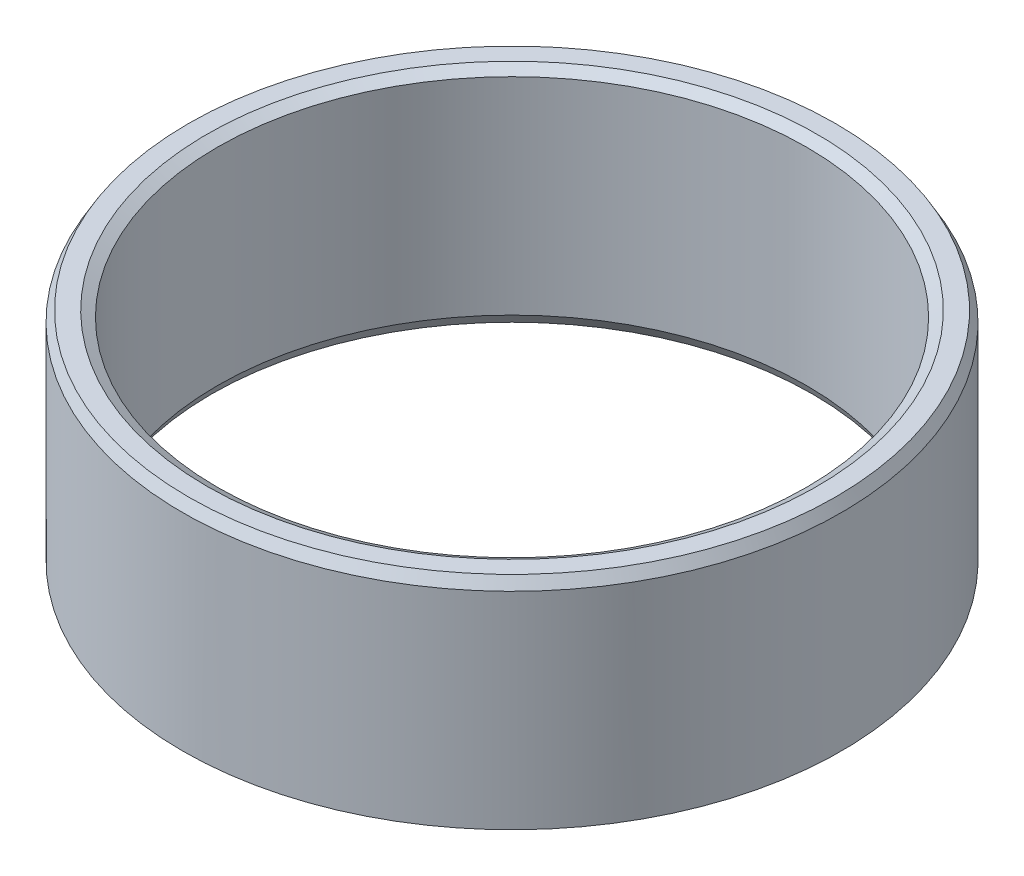
ISO-10303-21;
HEADER;
FILE_DESCRIPTION(('STEP AP214'),'2;1');
FILE_NAME('part.step','',(''),(''),'','','');
FILE_SCHEMA(('AUTOMOTIVE_DESIGN { 1 0 10303 214 1 1 1 1 }'));
ENDSEC;
DATA;
#1=APPLICATION_CONTEXT('core data for automotive mechanical design processes');
#2=APPLICATION_PROTOCOL_DEFINITION('international standard','automotive_design',2000,#1);
#3=PRODUCT_CONTEXT('',#1,'mechanical');
#4=PRODUCT('Part','Part','',(#3));
#5=PRODUCT_RELATED_PRODUCT_CATEGORY('part','',(#4));
#6=PRODUCT_DEFINITION_FORMATION('','',#4);
#7=PRODUCT_DEFINITION_CONTEXT('part definition',#1,'design');
#8=PRODUCT_DEFINITION('design','',#6,#7);
#9=PRODUCT_DEFINITION_SHAPE('','',#8);
#10=(LENGTH_UNIT() NAMED_UNIT(*) SI_UNIT(.MILLI.,.METRE.));
#11=(NAMED_UNIT(*) PLANE_ANGLE_UNIT() SI_UNIT($,.RADIAN.));
#12=(NAMED_UNIT(*) SI_UNIT($,.STERADIAN.) SOLID_ANGLE_UNIT());
#13=UNCERTAINTY_MEASURE_WITH_UNIT(LENGTH_MEASURE(1.E-05),#10,'distance_accuracy_value','');
#14=(GEOMETRIC_REPRESENTATION_CONTEXT(3) GLOBAL_UNCERTAINTY_ASSIGNED_CONTEXT((#13)) GLOBAL_UNIT_ASSIGNED_CONTEXT((#10,
#11,#12)) REPRESENTATION_CONTEXT('',''));
#15=CARTESIAN_POINT('',(0.,0.,0.));
#16=DIRECTION('',(0.,0.,1.));
#17=DIRECTION('',(1.,0.,0.));
#18=AXIS2_PLACEMENT_3D('',#15,#16,#17);
#19=CARTESIAN_POINT('',(0.,30.4410566035507,0.));
#20=DIRECTION('',(0.,-1.,0.));
#21=DIRECTION('',(0.,0.,-1.));
#22=AXIS2_PLACEMENT_3D('',#19,#20,#21);
#23=CYLINDRICAL_SURFACE('',#22,45.);
#24=CARTESIAN_POINT('',(0.,0.821626404880212,0.));
#25=DIRECTION('',(0.,1.,0.));
#26=DIRECTION('',(0.,0.,1.));
#27=AXIS2_PLACEMENT_3D('',#24,#25,#26);
#28=CIRCLE('',#27,45.);
#29=CARTESIAN_POINT('',(0.,0.821626404880212,45.));
#30=VERTEX_POINT('',#29);
#31=EDGE_CURVE('E10',#30,#30,#28,.T.);
#32=ORIENTED_EDGE('',*,*,#31,.T.);
#33=EDGE_LOOP('',(#32));
#34=FACE_BOUND('',#33,.T.);
#35=CARTESIAN_POINT('',(0.,29.0179579254579,0.));
#36=DIRECTION('',(0.,1.,0.));
#37=DIRECTION('',(0.,0.,1.));
#38=AXIS2_PLACEMENT_3D('',#35,#36,#37);
#39=CIRCLE('',#38,45.);
#40=CARTESIAN_POINT('',(0.,29.0179579254579,-45.));
#41=VERTEX_POINT('',#40);
#42=EDGE_CURVE('E50',#41,#41,#39,.F.);
#43=ORIENTED_EDGE('',*,*,#42,.T.);
#44=EDGE_LOOP('',(#43));
#45=FACE_BOUND('',#44,.T.);
#46=ADVANCED_FACE('F39',(#34,#45),#23,.T.);
#47=CARTESIAN_POINT('',(0.,30.4410566035507,0.));
#48=DIRECTION('',(0.,1.,0.));
#49=DIRECTION('',(0.,0.,1.));
#50=AXIS2_PLACEMENT_3D('',#47,#48,#49);
#51=PLANE('',#50);
#52=CARTESIAN_POINT('',(0.,30.4410566035507,0.));
#53=DIRECTION('',(0.,1.,0.));
#54=DIRECTION('',(0.,0.,1.));
#55=AXIS2_PLACEMENT_3D('',#52,#53,#54);
#56=CIRCLE('',#55,41.6506942153513);
#57=CARTESIAN_POINT('',(0.,30.4410566035507,41.6506942153513));
#58=VERTEX_POINT('',#57);
#59=EDGE_CURVE('E58',#58,#58,#56,.F.);
#60=ORIENTED_EDGE('',*,*,#59,.T.);
#61=EDGE_LOOP('',(#60));
#62=FACE_BOUND('',#61,.T.);
#63=CARTESIAN_POINT('',(0.,30.4410566035507,0.));
#64=DIRECTION('',(0.,1.,0.));
#65=DIRECTION('',(0.,0.,1.));
#66=AXIS2_PLACEMENT_3D('',#63,#64,#65);
#67=CIRCLE('',#66,44.1783735951198);
#68=CARTESIAN_POINT('',(0.,30.4410566035507,-44.1783735951198));
#69=VERTEX_POINT('',#68);
#70=EDGE_CURVE('E61',#69,#69,#67,.T.);
#71=ORIENTED_EDGE('',*,*,#70,.T.);
#72=EDGE_LOOP('',(#71));
#73=FACE_BOUND('',#72,.T.);
#74=ADVANCED_FACE('F88',(#62,#73),#51,.T.);
#75=CARTESIAN_POINT('',(0.,0.,0.));
#76=DIRECTION('',(0.,1.,0.));
#77=DIRECTION('',(0.,0.,1.));
#78=AXIS2_PLACEMENT_3D('',#75,#76,#77);
#79=PLANE('',#78);
#80=CARTESIAN_POINT('',(0.,0.,0.));
#81=DIRECTION('',(0.,1.,0.));
#82=DIRECTION('',(0.,0.,1.));
#83=AXIS2_PLACEMENT_3D('',#80,#81,#82);
#84=CIRCLE('',#83,41.0492219421388);
#85=CARTESIAN_POINT('',(0.,0.,41.0492219421388));
#86=VERTEX_POINT('',#85);
#87=EDGE_CURVE('E51',#86,#86,#84,.T.);
#88=ORIENTED_EDGE('',*,*,#87,.T.);
#89=EDGE_LOOP('',(#88));
#90=FACE_BOUND('',#89,.T.);
#91=CARTESIAN_POINT('',(0.,0.,0.));
#92=DIRECTION('',(0.,1.,0.));
#93=DIRECTION('',(0.,0.,1.));
#94=AXIS2_PLACEMENT_3D('',#91,#92,#93);
#95=CIRCLE('',#94,43.5769013219073);
#96=CARTESIAN_POINT('',(0.,0.,43.5769013219073));
#97=VERTEX_POINT('',#96);
#98=EDGE_CURVE('E54',#97,#97,#95,.F.);
#99=ORIENTED_EDGE('',*,*,#98,.T.);
#100=EDGE_LOOP('',(#99));
#101=FACE_BOUND('',#100,.T.);
#102=ADVANCED_FACE('F83',(#90,#101),#79,.F.);
#103=CARTESIAN_POINT('',(0.,30.4410566035507,0.));
#104=DIRECTION('',(0.,-1.,0.));
#105=DIRECTION('',(0.,0.,-1.));
#106=AXIS2_PLACEMENT_3D('',#103,#104,#105);
#107=CYLINDRICAL_SURFACE('',#106,40.2275955372586);
#108=CARTESIAN_POINT('',(0.,29.6194301986704,0.));
#109=DIRECTION('',(0.,1.,0.));
#110=DIRECTION('',(0.,0.,1.));
#111=AXIS2_PLACEMENT_3D('',#108,#109,#110);
#112=CIRCLE('',#111,40.2275955372586);
#113=CARTESIAN_POINT('',(0.,29.6194301986704,40.2275955372586));
#114=VERTEX_POINT('',#113);
#115=EDGE_CURVE('E67',#114,#114,#112,.T.);
#116=ORIENTED_EDGE('',*,*,#115,.T.);
#117=EDGE_LOOP('',(#116));
#118=FACE_BOUND('',#117,.T.);
#119=CARTESIAN_POINT('',(0.,1.42309867809272,0.));
#120=DIRECTION('',(0.,1.,0.));
#121=DIRECTION('',(0.,0.,1.));
#122=AXIS2_PLACEMENT_3D('',#119,#120,#121);
#123=CIRCLE('',#122,40.2275955372586);
#124=CARTESIAN_POINT('',(0.,1.42309867809272,40.2275955372586));
#125=VERTEX_POINT('',#124);
#126=EDGE_CURVE('E69',#125,#125,#123,.F.);
#127=ORIENTED_EDGE('',*,*,#126,.T.);
#128=EDGE_LOOP('',(#127));
#129=FACE_BOUND('',#128,.T.);
#130=ADVANCED_FACE('F71',(#118,#129),#107,.F.);
#131=CARTESIAN_POINT('',(0.,29.6194301986704,0.));
#132=DIRECTION('',(0.,1.,0.));
#133=DIRECTION('',(0.,0.,1.));
#134=AXIS2_PLACEMENT_3D('',#131,#132,#133);
#135=CONICAL_SURFACE('',#134,40.2275955372586,1.0471975511966);
#136=ORIENTED_EDGE('',*,*,#59,.F.);
#137=EDGE_LOOP('',(#136));
#138=FACE_BOUND('',#137,.T.);
#139=ORIENTED_EDGE('',*,*,#115,.F.);
#140=EDGE_LOOP('',(#139));
#141=FACE_BOUND('',#140,.T.);
#142=ADVANCED_FACE('F77',(#138,#141),#135,.F.);
#143=CARTESIAN_POINT('',(0.,0.,0.));
#144=DIRECTION('',(0.,-1.,0.));
#145=DIRECTION('',(0.,0.,-1.));
#146=AXIS2_PLACEMENT_3D('',#143,#144,#145);
#147=CONICAL_SURFACE('',#146,41.0492219421388,0.523598775598299);
#148=ORIENTED_EDGE('',*,*,#126,.F.);
#149=EDGE_LOOP('',(#148));
#150=FACE_BOUND('',#149,.T.);
#151=ORIENTED_EDGE('',*,*,#87,.F.);
#152=EDGE_LOOP('',(#151));
#153=FACE_BOUND('',#152,.T.);
#154=ADVANCED_FACE('F73',(#150,#153),#147,.F.);
#155=CARTESIAN_POINT('',(0.,0.821626404880212,0.));
#156=DIRECTION('',(0.,1.,0.));
#157=DIRECTION('',(0.,0.,1.));
#158=AXIS2_PLACEMENT_3D('',#155,#156,#157);
#159=CONICAL_SURFACE('',#158,45.,1.0471975511966);
#160=ORIENTED_EDGE('',*,*,#98,.F.);
#161=EDGE_LOOP('',(#160));
#162=FACE_BOUND('',#161,.T.);
#163=ORIENTED_EDGE('',*,*,#31,.F.);
#164=EDGE_LOOP('',(#163));
#165=FACE_BOUND('',#164,.T.);
#166=ADVANCED_FACE('F76',(#162,#165),#159,.T.);
#167=CARTESIAN_POINT('',(0.,30.4410566035507,0.));
#168=DIRECTION('',(0.,-1.,0.));
#169=DIRECTION('',(0.,0.,-1.));
#170=AXIS2_PLACEMENT_3D('',#167,#168,#169);
#171=CONICAL_SURFACE('',#170,44.1783735951198,0.523598775598299);
#172=CARTESIAN_POINT('',(0.,29.0179579254579,-45.));
#173=CARTESIAN_POINT('',(0.,29.0327818700214,-44.9914413916158));
#174=CARTESIAN_POINT('',(0.,29.0476058145849,-44.9828827832317));
#175=CARTESIAN_POINT('',(0.,29.0772537037118,-44.9657655664633));
#176=CARTESIAN_POINT('',(0.,29.0920776482752,-44.9572069580792));
#177=CARTESIAN_POINT('',(0.,29.1217255374022,-44.9400897413108));
#178=CARTESIAN_POINT('',(0.,29.1365494819656,-44.9315311329267));
#179=CARTESIAN_POINT('',(0.,29.1661973710926,-44.9144139161583));
#180=CARTESIAN_POINT('',(0.,29.181021315656,-44.9058553077741));
#181=CARTESIAN_POINT('',(0.,29.210669204783,-44.8887380910058));
#182=CARTESIAN_POINT('',(0.,29.2254931493464,-44.8801794826216));
#183=CARTESIAN_POINT('',(0.,29.2551410384734,-44.8630622658533));
#184=CARTESIAN_POINT('',(0.,29.2699649830368,-44.8545036574691));
#185=CARTESIAN_POINT('',(0.,29.2996128721638,-44.8373864407008));
#186=CARTESIAN_POINT('',(0.,29.3144368167272,-44.8288278323166));
#187=CARTESIAN_POINT('',(0.,29.3440847058542,-44.8117106155483));
#188=CARTESIAN_POINT('',(0.,29.3589086504176,-44.8031520071641));
#189=CARTESIAN_POINT('',(0.,29.3885565395446,-44.7860347903958));
#190=CARTESIAN_POINT('',(0.,29.403380484108,-44.7774761820116));
#191=CARTESIAN_POINT('',(0.,29.433028373235,-44.7603589652433));
#192=CARTESIAN_POINT('',(0.,29.4478523177984,-44.7518003568591));
#193=CARTESIAN_POINT('',(0.,29.4775002069254,-44.7346831400908));
#194=CARTESIAN_POINT('',(0.,29.4923241514888,-44.7261245317066));
#195=CARTESIAN_POINT('',(0.,29.5219720406158,-44.7090073149383));
#196=CARTESIAN_POINT('',(0.,29.5367959851792,-44.7004487065541));
#197=CARTESIAN_POINT('',(0.,29.5664438743062,-44.6833314897857));
#198=CARTESIAN_POINT('',(0.,29.5812678188696,-44.6747728814016));
#199=CARTESIAN_POINT('',(0.,29.6109157079966,-44.6576556646332));
#200=CARTESIAN_POINT('',(0.,29.62573965256,-44.6490970562491));
#201=CARTESIAN_POINT('',(0.,29.655387541687,-44.6319798394807));
#202=CARTESIAN_POINT('',(0.,29.6702114862504,-44.6234212310966));
#203=CARTESIAN_POINT('',(0.,29.6998593753774,-44.6063040143282));
#204=CARTESIAN_POINT('',(0.,29.7146833199408,-44.5977454059441));
#205=CARTESIAN_POINT('',(0.,29.7443312090678,-44.5806281891757));
#206=CARTESIAN_POINT('',(0.,29.7591551536312,-44.5720695807915));
#207=CARTESIAN_POINT('',(0.,29.7888030427581,-44.5549523640232));
#208=CARTESIAN_POINT('',(0.,29.8036269873216,-44.546393755639));
#209=CARTESIAN_POINT('',(0.,29.8332748764485,-44.5292765388707));
#210=CARTESIAN_POINT('',(0.,29.848098821012,-44.5207179304865));
#211=CARTESIAN_POINT('',(0.,29.8777467101389,-44.5036007137182));
#212=CARTESIAN_POINT('',(0.,29.8925706547024,-44.495042105334));
#213=CARTESIAN_POINT('',(0.,29.9222185438293,-44.4779248885657));
#214=CARTESIAN_POINT('',(0.,29.9370424883928,-44.4693662801815));
#215=CARTESIAN_POINT('',(0.,29.9666903775197,-44.4522490634132));
#216=CARTESIAN_POINT('',(0.,29.9815143220832,-44.443690455029));
#217=CARTESIAN_POINT('',(0.,30.0111622112101,-44.4265732382607));
#218=CARTESIAN_POINT('',(0.,30.0259861557736,-44.4180146298765));
#219=CARTESIAN_POINT('',(0.,30.0556340449005,-44.4008974131082));
#220=CARTESIAN_POINT('',(0.,30.070457989464,-44.392338804724));
#221=CARTESIAN_POINT('',(0.,30.1001058785909,-44.3752215879557));
#222=CARTESIAN_POINT('',(0.,30.1149298231544,-44.3666629795715));
#223=CARTESIAN_POINT('',(0.,30.1445777122813,-44.3495457628032));
#224=CARTESIAN_POINT('',(0.,30.1594016568448,-44.340987154419));
#225=CARTESIAN_POINT('',(0.,30.1890495459717,-44.3238699376506));
#226=CARTESIAN_POINT('',(0.,30.2038734905352,-44.3153113292665));
#227=CARTESIAN_POINT('',(0.,30.2335213796621,-44.2981941124981));
#228=CARTESIAN_POINT('',(0.,30.2483453242256,-44.289635504114));
#229=CARTESIAN_POINT('',(0.,30.2779932133525,-44.2725182873456));
#230=CARTESIAN_POINT('',(0.,30.292817157916,-44.2639596789615));
#231=CARTESIAN_POINT('',(0.,30.3224650470429,-44.2468424621931));
#232=CARTESIAN_POINT('',(0.,30.3372889916064,-44.238283853809));
#233=CARTESIAN_POINT('',(0.,30.3669368807333,-44.2211666370406));
#234=CARTESIAN_POINT('',(0.,30.3817608252968,-44.2126080286564));
#235=CARTESIAN_POINT('',(0.,30.4114087144237,-44.1954908118881));
#236=CARTESIAN_POINT('',(0.,30.4262326589872,-44.1869322035039));
#237=CARTESIAN_POINT('',(0.,30.4410566035507,-44.1783735951198));
#238=B_SPLINE_CURVE_WITH_KNOTS('',3,(#172,#173,#174,#175,#176,#177,#178,#179,#180,#181,#182,
#183,#184,#185,#186,#187,#188,#189,#190,#191,#192,#193,#194,#195,#196,#197,#198,#199,#200,#201,
#202,#203,#204,#205,#206,#207,#208,#209,#210,#211,#212,#213,#214,#215,#216,#217,#218,#219,#220,
#221,#222,#223,#224,#225,#226,#227,#228,#229,#230,#231,#232,#233,#234,#235,#236,#237),
.UNSPECIFIED.,.F.,.F.,(4,2,2,2,2,2,2,2,2,2,2,2,2,2,2,2,2,2,2,2,2,2,2,2,2,2,2,2,2,2,2,2,4),(0.,
0.0513516503050113,0.102703300610029,0.154054950915043,0.205406601220058,0.256758251525072,
0.308109901830087,0.359461552135105,0.410813202440119,0.46216485274513,0.513516503050148,
0.564868153355162,0.61621980366018,0.667571453965191,0.718923104270209,0.770274754575223,
0.821626404880238,0.872978055185253,0.924329705490267,0.975681355795285,1.0270330061003,
1.07838465640531,1.12973630671033,1.18108795701534,1.23243960732036,1.28379125762537,
1.33514290793039,1.3864945582354,1.43784620854042,1.48919785884543,1.54054950915045,
1.59190115945546,1.64325280976048),.UNSPECIFIED.);
#239=EDGE_CURVE('BSEAM45',#41,#69,#238,.T.);
#240=ORIENTED_EDGE('',*,*,#42,.F.);
#241=ORIENTED_EDGE('',*,*,#70,.F.);
#242=ORIENTED_EDGE('',*,*,#239,.T.);
#243=ORIENTED_EDGE('',*,*,#239,.F.);
#244=EDGE_LOOP('',(#240,#242,#241,#243));
#245=FACE_BOUND('',#244,.T.);
#246=ADVANCED_FACE('F45',(#245),#171,.T.);
#247=CLOSED_SHELL('',(#46,#74,#102,#130,#142,#154,#166,#246));
#248=MANIFOLD_SOLID_BREP('B2',#247);
#249=ADVANCED_BREP_SHAPE_REPRESENTATION('',(#18,#248),#14);
#250=SHAPE_DEFINITION_REPRESENTATION(#9,#249);
ENDSEC;
END-ISO-10303-21;
